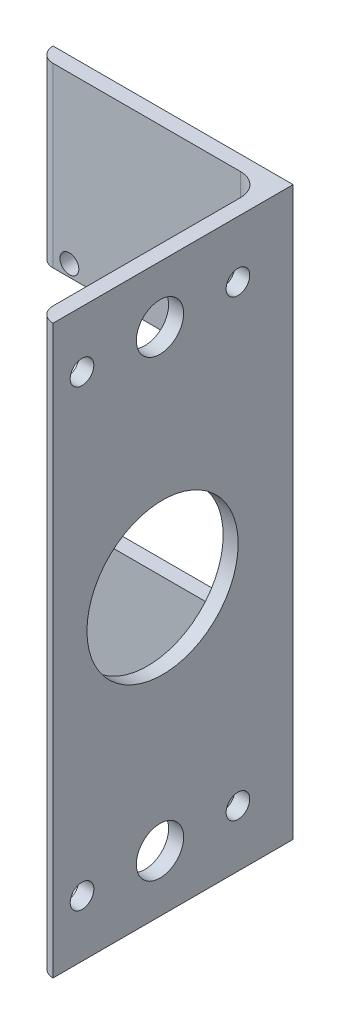
ISO-10303-21;
HEADER;
FILE_DESCRIPTION(('STEP AP214'),'2;1');
FILE_NAME('part.step','',(''),(''),'','','');
FILE_SCHEMA(('AUTOMOTIVE_DESIGN { 1 0 10303 214 1 1 1 1 }'));
ENDSEC;
DATA;
#1=APPLICATION_CONTEXT('core data for automotive mechanical design processes');
#2=APPLICATION_PROTOCOL_DEFINITION('international standard','automotive_design',2000,#1);
#3=PRODUCT_CONTEXT('',#1,'mechanical');
#4=PRODUCT('Part','Part','',(#3));
#5=PRODUCT_RELATED_PRODUCT_CATEGORY('part','',(#4));
#6=PRODUCT_DEFINITION_FORMATION('','',#4);
#7=PRODUCT_DEFINITION_CONTEXT('part definition',#1,'design');
#8=PRODUCT_DEFINITION('design','',#6,#7);
#9=PRODUCT_DEFINITION_SHAPE('','',#8);
#10=(LENGTH_UNIT() NAMED_UNIT(*) SI_UNIT(.MILLI.,.METRE.));
#11=(NAMED_UNIT(*) PLANE_ANGLE_UNIT() SI_UNIT($,.RADIAN.));
#12=(NAMED_UNIT(*) SI_UNIT($,.STERADIAN.) SOLID_ANGLE_UNIT());
#13=UNCERTAINTY_MEASURE_WITH_UNIT(LENGTH_MEASURE(1.E-05),#10,'distance_accuracy_value','');
#14=(GEOMETRIC_REPRESENTATION_CONTEXT(3) GLOBAL_UNCERTAINTY_ASSIGNED_CONTEXT((#13)) GLOBAL_UNIT_ASSIGNED_CONTEXT((#10,
#11,#12)) REPRESENTATION_CONTEXT('',''));
#15=CARTESIAN_POINT('',(0.,0.,0.));
#16=DIRECTION('',(0.,0.,1.));
#17=DIRECTION('',(1.,0.,0.));
#18=AXIS2_PLACEMENT_3D('',#15,#16,#17);
#19=CARTESIAN_POINT('',(-3.175,120.,47.63008));
#20=DIRECTION('',(1.,0.,0.));
#21=DIRECTION('',(0.,0.,-1.));
#22=AXIS2_PLACEMENT_3D('',#19,#20,#21);
#23=PLANE('',#22);
#24=CARTESIAN_POINT('',(-3.175,60.,27.63008));
#25=DIRECTION('',(-1.,0.,0.));
#26=DIRECTION('',(0.,0.,1.));
#27=AXIS2_PLACEMENT_3D('',#24,#25,#26);
#28=CIRCLE('',#27,16.);
#29=CARTESIAN_POINT('',(-3.175,60.,43.63008));
#30=VERTEX_POINT('',#29);
#31=EDGE_CURVE('E569',#30,#30,#28,.T.);
#32=ORIENTED_EDGE('',*,*,#31,.F.);
#33=EDGE_LOOP('',(#32));
#34=FACE_BOUND('',#33,.T.);
#35=CARTESIAN_POINT('',(-3.175,12.,11.675));
#36=DIRECTION('',(-1.,0.,0.));
#37=DIRECTION('',(0.,0.,1.));
#38=AXIS2_PLACEMENT_3D('',#35,#36,#37);
#39=CIRCLE('',#38,2.5);
#40=CARTESIAN_POINT('',(-3.175,12.,14.175));
#41=VERTEX_POINT('',#40);
#42=EDGE_CURVE('E579',#41,#41,#39,.T.);
#43=ORIENTED_EDGE('',*,*,#42,.F.);
#44=EDGE_LOOP('',(#43));
#45=FACE_BOUND('',#44,.T.);
#46=CARTESIAN_POINT('',(-3.17499999999998,12.,44.675));
#47=DIRECTION('',(-1.,0.,0.));
#48=DIRECTION('',(0.,0.,1.));
#49=AXIS2_PLACEMENT_3D('',#46,#47,#48);
#50=CIRCLE('',#49,2.5);
#51=CARTESIAN_POINT('',(-3.17499999999998,12.,47.175));
#52=VERTEX_POINT('',#51);
#53=EDGE_CURVE('E582',#52,#52,#50,.T.);
#54=ORIENTED_EDGE('',*,*,#53,.F.);
#55=EDGE_LOOP('',(#54));
#56=FACE_BOUND('',#55,.T.);
#57=CARTESIAN_POINT('',(-3.175,12.,28.175));
#58=DIRECTION('',(-1.,0.,0.));
#59=DIRECTION('',(0.,0.,1.));
#60=AXIS2_PLACEMENT_3D('',#57,#58,#59);
#61=CIRCLE('',#60,5.);
#62=CARTESIAN_POINT('',(-3.17499999999999,12.,33.175));
#63=VERTEX_POINT('',#62);
#64=EDGE_CURVE('E245',#63,#63,#61,.T.);
#65=ORIENTED_EDGE('',*,*,#64,.F.);
#66=EDGE_LOOP('',(#65));
#67=FACE_BOUND('',#66,.T.);
#68=DIRECTION('',(0.,-1.,0.));
#69=VECTOR('',#68,1.);
#70=CARTESIAN_POINT('',(-3.17500000000001,120.,7.93749999999999));
#71=LINE('',#70,#69);
#72=CARTESIAN_POINT('',(-3.17500000000001,120.,7.93749999999999));
#73=VERTEX_POINT('',#72);
#74=CARTESIAN_POINT('',(-3.17500000000001,82.5,7.93749999999999));
#75=VERTEX_POINT('',#74);
#76=EDGE_CURVE('E226',#73,#75,#71,.T.);
#77=ORIENTED_EDGE('',*,*,#76,.T.);
#78=DIRECTION('',(0.,0.,-1.));
#79=VECTOR('',#78,1.);
#80=CARTESIAN_POINT('',(-3.175,82.5,10.));
#81=LINE('',#80,#79);
#82=CARTESIAN_POINT('',(-3.175,82.5,0.));
#83=VERTEX_POINT('',#82);
#84=EDGE_CURVE('E100',#75,#83,#81,.T.);
#85=ORIENTED_EDGE('',*,*,#84,.T.);
#86=DIRECTION('',(0.,-1.,0.));
#87=VECTOR('',#86,1.);
#88=CARTESIAN_POINT('',(-3.175,82.5,0.));
#89=LINE('',#88,#87);
#90=CARTESIAN_POINT('',(-3.175,37.5,0.));
#91=VERTEX_POINT('',#90);
#92=EDGE_CURVE('E261',#83,#91,#89,.T.);
#93=ORIENTED_EDGE('',*,*,#92,.T.);
#94=DIRECTION('',(0.,0.,-1.));
#95=VECTOR('',#94,1.);
#96=CARTESIAN_POINT('',(-3.175,37.5,10.));
#97=LINE('',#96,#95);
#98=CARTESIAN_POINT('',(-3.175,37.5,7.93749999999999));
#99=VERTEX_POINT('',#98);
#100=EDGE_CURVE('E280',#99,#91,#97,.T.);
#101=ORIENTED_EDGE('',*,*,#100,.F.);
#102=CARTESIAN_POINT('',(-3.17500000000001,0.,7.93749999999999));
#103=VERTEX_POINT('',#102);
#104=EDGE_CURVE('E225',#99,#103,#71,.T.);
#105=ORIENTED_EDGE('',*,*,#104,.T.);
#106=DIRECTION('',(0.,0.,1.));
#107=VECTOR('',#106,1.);
#108=CARTESIAN_POINT('',(-3.175,0.,47.63008));
#109=LINE('',#108,#107);
#110=CARTESIAN_POINT('',(-3.175,0.,47.63008));
#111=VERTEX_POINT('',#110);
#112=EDGE_CURVE('E215',#103,#111,#109,.T.);
#113=ORIENTED_EDGE('',*,*,#112,.T.);
#114=DIRECTION('',(0.,-1.,0.));
#115=VECTOR('',#114,1.);
#116=CARTESIAN_POINT('',(-3.17499999999998,120.,47.63008));
#117=LINE('',#116,#115);
#118=CARTESIAN_POINT('',(-3.17499999999998,120.,47.63008));
#119=VERTEX_POINT('',#118);
#120=EDGE_CURVE('E190',#119,#111,#117,.T.);
#121=ORIENTED_EDGE('',*,*,#120,.F.);
#122=DIRECTION('',(0.,0.,1.));
#123=VECTOR('',#122,1.);
#124=CARTESIAN_POINT('',(-3.175,120.,47.63008));
#125=LINE('',#124,#123);
#126=EDGE_CURVE('E178',#73,#119,#125,.T.);
#127=ORIENTED_EDGE('',*,*,#126,.F.);
#128=EDGE_LOOP('',(#77,#85,#93,#101,#105,#113,#121,#127));
#129=FACE_BOUND('',#128,.T.);
#130=CARTESIAN_POINT('',(-3.17500000000001,108.,11.675));
#131=DIRECTION('',(-1.,0.,0.));
#132=DIRECTION('',(0.,0.,1.));
#133=AXIS2_PLACEMENT_3D('',#130,#131,#132);
#134=CIRCLE('',#133,2.5);
#135=CARTESIAN_POINT('',(-3.17500000000001,108.,14.175));
#136=VERTEX_POINT('',#135);
#137=EDGE_CURVE('E575',#136,#136,#134,.F.);
#138=ORIENTED_EDGE('',*,*,#137,.T.);
#139=EDGE_LOOP('',(#138));
#140=FACE_BOUND('',#139,.T.);
#141=CARTESIAN_POINT('',(-3.175,108.,28.175));
#142=DIRECTION('',(-1.,0.,0.));
#143=DIRECTION('',(0.,0.,1.));
#144=AXIS2_PLACEMENT_3D('',#141,#142,#143);
#145=CIRCLE('',#144,5.);
#146=CARTESIAN_POINT('',(-3.17499999999999,108.,33.175));
#147=VERTEX_POINT('',#146);
#148=EDGE_CURVE('E578',#147,#147,#145,.F.);
#149=ORIENTED_EDGE('',*,*,#148,.T.);
#150=EDGE_LOOP('',(#149));
#151=FACE_BOUND('',#150,.T.);
#152=CARTESIAN_POINT('',(-3.175,108.,44.675));
#153=DIRECTION('',(-1.,0.,0.));
#154=DIRECTION('',(0.,0.,1.));
#155=AXIS2_PLACEMENT_3D('',#152,#153,#154);
#156=CIRCLE('',#155,2.5);
#157=CARTESIAN_POINT('',(-3.175,108.,47.175));
#158=VERTEX_POINT('',#157);
#159=EDGE_CURVE('E585',#158,#158,#156,.F.);
#160=ORIENTED_EDGE('',*,*,#159,.T.);
#161=EDGE_LOOP('',(#160));
#162=FACE_BOUND('',#161,.T.);
#163=ADVANCED_FACE('F83',(#34,#45,#56,#67,#129,#140,#151,#162),#23,.F.);
#164=CARTESIAN_POINT('',(0.,120.,0.));
#165=DIRECTION('',(-1.,0.,0.));
#166=DIRECTION('',(0.,0.,1.));
#167=AXIS2_PLACEMENT_3D('',#164,#165,#166);
#168=PLANE('',#167);
#169=CARTESIAN_POINT('',(0.,60.,27.63008));
#170=DIRECTION('',(-1.,0.,0.));
#171=DIRECTION('',(0.,0.,1.));
#172=AXIS2_PLACEMENT_3D('',#169,#170,#171);
#173=CIRCLE('',#172,16.);
#174=CARTESIAN_POINT('',(0.,60.,43.63008));
#175=VERTEX_POINT('',#174);
#176=EDGE_CURVE('E572',#175,#175,#173,.F.);
#177=ORIENTED_EDGE('',*,*,#176,.F.);
#178=EDGE_LOOP('',(#177));
#179=FACE_BOUND('',#178,.T.);
#180=CARTESIAN_POINT('',(0.,12.,11.675));
#181=DIRECTION('',(-1.,0.,0.));
#182=DIRECTION('',(0.,0.,1.));
#183=AXIS2_PLACEMENT_3D('',#180,#181,#182);
#184=CIRCLE('',#183,2.5);
#185=CARTESIAN_POINT('',(0.,12.,14.175));
#186=VERTEX_POINT('',#185);
#187=EDGE_CURVE('E87',#186,#186,#184,.T.);
#188=ORIENTED_EDGE('',*,*,#187,.T.);
#189=EDGE_LOOP('',(#188));
#190=FACE_BOUND('',#189,.T.);
#191=CARTESIAN_POINT('',(0.,12.,44.675));
#192=DIRECTION('',(-1.,0.,0.));
#193=DIRECTION('',(0.,0.,1.));
#194=AXIS2_PLACEMENT_3D('',#191,#192,#193);
#195=CIRCLE('',#194,2.5);
#196=CARTESIAN_POINT('',(0.,12.,47.175));
#197=VERTEX_POINT('',#196);
#198=EDGE_CURVE('E253',#197,#197,#195,.T.);
#199=ORIENTED_EDGE('',*,*,#198,.T.);
#200=EDGE_LOOP('',(#199));
#201=FACE_BOUND('',#200,.T.);
#202=CARTESIAN_POINT('',(0.,12.,28.175));
#203=DIRECTION('',(-1.,0.,0.));
#204=DIRECTION('',(0.,0.,1.));
#205=AXIS2_PLACEMENT_3D('',#202,#203,#204);
#206=CIRCLE('',#205,5.);
#207=CARTESIAN_POINT('',(0.,12.,33.175));
#208=VERTEX_POINT('',#207);
#209=EDGE_CURVE('E241',#208,#208,#206,.T.);
#210=ORIENTED_EDGE('',*,*,#209,.T.);
#211=EDGE_LOOP('',(#210));
#212=FACE_BOUND('',#211,.T.);
#213=DIRECTION('',(0.,0.,-1.));
#214=VECTOR('',#213,1.);
#215=CARTESIAN_POINT('',(0.,0.,0.));
#216=LINE('',#215,#214);
#217=CARTESIAN_POINT('',(0.,0.,50.8));
#218=VERTEX_POINT('',#217);
#219=CARTESIAN_POINT('',(0.,0.,0.));
#220=VERTEX_POINT('',#219);
#221=EDGE_CURVE('E145',#218,#220,#216,.T.);
#222=ORIENTED_EDGE('',*,*,#221,.T.);
#223=DIRECTION('',(0.,-1.,0.));
#224=VECTOR('',#223,1.);
#225=CARTESIAN_POINT('',(0.,120.,0.));
#226=LINE('',#225,#224);
#227=CARTESIAN_POINT('',(0.,120.,0.));
#228=VERTEX_POINT('',#227);
#229=EDGE_CURVE('E195',#228,#220,#226,.T.);
#230=ORIENTED_EDGE('',*,*,#229,.F.);
#231=DIRECTION('',(0.,0.,-1.));
#232=VECTOR('',#231,1.);
#233=CARTESIAN_POINT('',(0.,120.,0.));
#234=LINE('',#233,#232);
#235=CARTESIAN_POINT('',(0.,120.,50.8));
#236=VERTEX_POINT('',#235);
#237=EDGE_CURVE('E109',#236,#228,#234,.T.);
#238=ORIENTED_EDGE('',*,*,#237,.F.);
#239=DIRECTION('',(0.,-1.,0.));
#240=VECTOR('',#239,1.);
#241=CARTESIAN_POINT('',(0.,120.,50.8));
#242=LINE('',#241,#240);
#243=EDGE_CURVE('E191',#236,#218,#242,.T.);
#244=ORIENTED_EDGE('',*,*,#243,.T.);
#245=EDGE_LOOP('',(#222,#230,#238,#244));
#246=FACE_BOUND('',#245,.T.);
#247=CARTESIAN_POINT('',(0.,108.,11.675));
#248=DIRECTION('',(-1.,0.,0.));
#249=DIRECTION('',(0.,0.,1.));
#250=AXIS2_PLACEMENT_3D('',#247,#248,#249);
#251=CIRCLE('',#250,2.5);
#252=CARTESIAN_POINT('',(0.,108.,14.175));
#253=VERTEX_POINT('',#252);
#254=EDGE_CURVE('E244',#253,#253,#251,.F.);
#255=ORIENTED_EDGE('',*,*,#254,.F.);
#256=EDGE_LOOP('',(#255));
#257=FACE_BOUND('',#256,.T.);
#258=CARTESIAN_POINT('',(0.,108.,28.175));
#259=DIRECTION('',(-1.,0.,0.));
#260=DIRECTION('',(0.,0.,1.));
#261=AXIS2_PLACEMENT_3D('',#258,#259,#260);
#262=CIRCLE('',#261,5.);
#263=CARTESIAN_POINT('',(0.,108.,33.175));
#264=VERTEX_POINT('',#263);
#265=EDGE_CURVE('E248',#264,#264,#262,.F.);
#266=ORIENTED_EDGE('',*,*,#265,.F.);
#267=EDGE_LOOP('',(#266));
#268=FACE_BOUND('',#267,.T.);
#269=CARTESIAN_POINT('',(0.,108.,44.675));
#270=DIRECTION('',(-1.,0.,0.));
#271=DIRECTION('',(0.,0.,1.));
#272=AXIS2_PLACEMENT_3D('',#269,#270,#271);
#273=CIRCLE('',#272,2.5);
#274=CARTESIAN_POINT('',(0.,108.,47.175));
#275=VERTEX_POINT('',#274);
#276=EDGE_CURVE('E251',#275,#275,#273,.F.);
#277=ORIENTED_EDGE('',*,*,#276,.F.);
#278=EDGE_LOOP('',(#277));
#279=FACE_BOUND('',#278,.T.);
#280=ADVANCED_FACE('F320',(#179,#190,#201,#212,#246,#257,#268,#279),#168,.F.);
#281=CARTESIAN_POINT('',(-50.8,120.,0.00507999999999065));
#282=DIRECTION('',(1.,0.,0.));
#283=DIRECTION('',(0.,0.,-1.));
#284=AXIS2_PLACEMENT_3D('',#281,#282,#283);
#285=PLANE('',#284);
#286=DIRECTION('',(0.,-1.,0.));
#287=VECTOR('',#286,1.);
#288=CARTESIAN_POINT('',(-50.8,120.,0.00507999999999065));
#289=LINE('',#288,#287);
#290=CARTESIAN_POINT('',(-50.8,37.5,0.00507999999999065));
#291=VERTEX_POINT('',#290);
#292=CARTESIAN_POINT('',(-50.8,0.,0.00507999999999065));
#293=VERTEX_POINT('',#292);
#294=EDGE_CURVE('E237',#291,#293,#289,.T.);
#295=ORIENTED_EDGE('',*,*,#294,.F.);
#296=DIRECTION('',(0.,0.,-1.));
#297=VECTOR('',#296,1.);
#298=CARTESIAN_POINT('',(-50.8,37.5,10.));
#299=LINE('',#298,#297);
#300=CARTESIAN_POINT('',(-50.8,37.5,0.));
#301=VERTEX_POINT('',#300);
#302=EDGE_CURVE('E276',#291,#301,#299,.T.);
#303=ORIENTED_EDGE('',*,*,#302,.T.);
#304=DIRECTION('',(0.,-1.,0.));
#305=VECTOR('',#304,1.);
#306=CARTESIAN_POINT('',(-50.8,120.,0.));
#307=LINE('',#306,#305);
#308=CARTESIAN_POINT('',(-50.8,0.,0.));
#309=VERTEX_POINT('',#308);
#310=EDGE_CURVE('E92',#301,#309,#307,.T.);
#311=ORIENTED_EDGE('',*,*,#310,.T.);
#312=DIRECTION('',(0.,0.,1.));
#313=VECTOR('',#312,1.);
#314=CARTESIAN_POINT('',(-50.8,0.,0.00507999999999065));
#315=LINE('',#314,#313);
#316=EDGE_CURVE('E202',#309,#293,#315,.T.);
#317=ORIENTED_EDGE('',*,*,#316,.T.);
#318=EDGE_LOOP('',(#295,#303,#311,#317));
#319=FACE_BOUND('',#318,.T.);
#320=ADVANCED_FACE('F373',(#319),#285,.F.);
#321=CARTESIAN_POINT('',(-47.63008,120.,0.00507999999999065));
#322=DIRECTION('',(0.,-1.,0.));
#323=DIRECTION('',(0.,0.,-1.));
#324=AXIS2_PLACEMENT_3D('',#321,#322,#323);
#325=CYLINDRICAL_SURFACE('',#324,3.16992);
#326=DIRECTION('',(0.,-1.,0.));
#327=VECTOR('',#326,1.);
#328=CARTESIAN_POINT('',(-47.63008,120.,3.17500000000001));
#329=LINE('',#328,#327);
#330=CARTESIAN_POINT('',(-47.63008,37.5,3.17500000000001));
#331=VERTEX_POINT('',#330);
#332=CARTESIAN_POINT('',(-47.63008,0.,3.17500000000001));
#333=VERTEX_POINT('',#332);
#334=EDGE_CURVE('E233',#331,#333,#329,.T.);
#335=ORIENTED_EDGE('',*,*,#334,.F.);
#336=CARTESIAN_POINT('',(-47.63008,37.5,0.00507999999999065));
#337=DIRECTION('',(0.,-1.,0.));
#338=DIRECTION('',(0.,0.,-1.));
#339=AXIS2_PLACEMENT_3D('',#336,#337,#338);
#340=CIRCLE('',#339,3.16992);
#341=EDGE_CURVE('E203',#331,#291,#340,.T.);
#342=ORIENTED_EDGE('',*,*,#341,.T.);
#343=ORIENTED_EDGE('',*,*,#294,.T.);
#344=CARTESIAN_POINT('',(-47.63008,0.,0.00507999999999065));
#345=DIRECTION('',(0.,1.,0.));
#346=DIRECTION('',(0.,0.,1.));
#347=AXIS2_PLACEMENT_3D('',#344,#345,#346);
#348=CIRCLE('',#347,3.16992);
#349=EDGE_CURVE('E206',#293,#333,#348,.T.);
#350=ORIENTED_EDGE('',*,*,#349,.T.);
#351=EDGE_LOOP('',(#335,#342,#343,#350));
#352=FACE_BOUND('',#351,.T.);
#353=ADVANCED_FACE('F361',(#352),#325,.T.);
#354=CARTESIAN_POINT('',(-7.93750000000001,120.,3.17499999999998));
#355=DIRECTION('',(0.,0.,-1.));
#356=DIRECTION('',(-1.,0.,0.));
#357=AXIS2_PLACEMENT_3D('',#354,#355,#356);
#358=PLANE('',#357);
#359=CARTESIAN_POINT('',(-44.1750000000011,34.9999999999983,3.17500000000001));
#360=DIRECTION('',(0.,0.,-1.));
#361=DIRECTION('',(-1.,0.,0.));
#362=AXIS2_PLACEMENT_3D('',#359,#360,#361);
#363=CIRCLE('',#362,2.);
#364=CARTESIAN_POINT('',(-46.1750000000011,34.9999999999983,3.17500000000001));
#365=VERTEX_POINT('',#364);
#366=EDGE_CURVE('E550',#365,#365,#363,.F.);
#367=ORIENTED_EDGE('',*,*,#366,.F.);
#368=EDGE_LOOP('',(#367));
#369=FACE_BOUND('',#368,.T.);
#370=CARTESIAN_POINT('',(-14.1750000000011,34.999999999998,3.17499999999998));
#371=DIRECTION('',(0.,0.,-1.));
#372=DIRECTION('',(-1.,0.,0.));
#373=AXIS2_PLACEMENT_3D('',#370,#371,#372);
#374=CIRCLE('',#373,2.);
#375=CARTESIAN_POINT('',(-16.1750000000011,34.999999999998,3.17499999999998));
#376=VERTEX_POINT('',#375);
#377=EDGE_CURVE('E565',#376,#376,#374,.F.);
#378=ORIENTED_EDGE('',*,*,#377,.F.);
#379=EDGE_LOOP('',(#378));
#380=FACE_BOUND('',#379,.T.);
#381=DIRECTION('',(0.,-1.,0.));
#382=VECTOR('',#381,1.);
#383=CARTESIAN_POINT('',(-7.93750000000001,120.,3.17499999999998));
#384=LINE('',#383,#382);
#385=CARTESIAN_POINT('',(-7.9375,37.5,3.17499999999998));
#386=VERTEX_POINT('',#385);
#387=CARTESIAN_POINT('',(-7.93750000000001,0.,3.17499999999998));
#388=VERTEX_POINT('',#387);
#389=EDGE_CURVE('E229',#386,#388,#384,.T.);
#390=ORIENTED_EDGE('',*,*,#389,.F.);
#391=DIRECTION('',(-1.,0.,0.));
#392=VECTOR('',#391,1.);
#393=CARTESIAN_POINT('',(-7.9375,37.5,3.17499999999998));
#394=LINE('',#393,#392);
#395=EDGE_CURVE('E295',#386,#331,#394,.T.);
#396=ORIENTED_EDGE('',*,*,#395,.T.);
#397=ORIENTED_EDGE('',*,*,#334,.T.);
#398=DIRECTION('',(1.,0.,0.));
#399=VECTOR('',#398,1.);
#400=CARTESIAN_POINT('',(-7.93750000000001,0.,3.17499999999998));
#401=LINE('',#400,#399);
#402=EDGE_CURVE('E209',#333,#388,#401,.T.);
#403=ORIENTED_EDGE('',*,*,#402,.T.);
#404=EDGE_LOOP('',(#390,#396,#397,#403));
#405=FACE_BOUND('',#404,.T.);
#406=ADVANCED_FACE('F360',(#369,#380,#405),#358,.F.);
#407=CARTESIAN_POINT('',(-7.93750000000001,120.,7.93749999999999));
#408=DIRECTION('',(0.,-1.,0.));
#409=DIRECTION('',(0.,0.,-1.));
#410=AXIS2_PLACEMENT_3D('',#407,#408,#409);
#411=CYLINDRICAL_SURFACE('',#410,4.7625);
#412=ORIENTED_EDGE('',*,*,#104,.F.);
#413=CARTESIAN_POINT('',(-7.9375,37.5,7.93749999999999));
#414=DIRECTION('',(0.,-1.,0.));
#415=DIRECTION('',(0.,0.,-1.));
#416=AXIS2_PLACEMENT_3D('',#413,#414,#415);
#417=CIRCLE('',#416,4.7625);
#418=EDGE_CURVE('E292',#99,#386,#417,.F.);
#419=ORIENTED_EDGE('',*,*,#418,.T.);
#420=ORIENTED_EDGE('',*,*,#389,.T.);
#421=CARTESIAN_POINT('',(-7.93750000000001,0.,7.93749999999999));
#422=DIRECTION('',(0.,-1.,0.));
#423=DIRECTION('',(0.,0.,-1.));
#424=AXIS2_PLACEMENT_3D('',#421,#422,#423);
#425=CIRCLE('',#424,4.7625);
#426=EDGE_CURVE('E212',#388,#103,#425,.T.);
#427=ORIENTED_EDGE('',*,*,#426,.T.);
#428=EDGE_LOOP('',(#412,#419,#420,#427));
#429=FACE_BOUND('',#428,.T.);
#430=ADVANCED_FACE('F367',(#429),#411,.F.);
#431=CARTESIAN_POINT('',(-50.8,120.,0.));
#432=DIRECTION('',(0.,0.,1.));
#433=DIRECTION('',(1.,0.,0.));
#434=AXIS2_PLACEMENT_3D('',#431,#432,#433);
#435=PLANE('',#434);
#436=CARTESIAN_POINT('',(-44.1750000000011,34.9999999999983,0.));
#437=DIRECTION('',(0.,0.,-1.));
#438=DIRECTION('',(-1.,0.,0.));
#439=AXIS2_PLACEMENT_3D('',#436,#437,#438);
#440=CIRCLE('',#439,2.);
#441=CARTESIAN_POINT('',(-46.1750000000011,34.9999999999983,0.));
#442=VERTEX_POINT('',#441);
#443=EDGE_CURVE('E553',#442,#442,#440,.T.);
#444=ORIENTED_EDGE('',*,*,#443,.F.);
#445=EDGE_LOOP('',(#444));
#446=FACE_BOUND('',#445,.T.);
#447=CARTESIAN_POINT('',(-44.1750000000005,84.9999999999983,0.));
#448=DIRECTION('',(0.,0.,-1.));
#449=DIRECTION('',(-1.,0.,0.));
#450=AXIS2_PLACEMENT_3D('',#447,#448,#449);
#451=CIRCLE('',#450,2.);
#452=CARTESIAN_POINT('',(-46.1750000000006,84.9999999999983,0.));
#453=VERTEX_POINT('',#452);
#454=EDGE_CURVE('E556',#453,#453,#451,.T.);
#455=ORIENTED_EDGE('',*,*,#454,.F.);
#456=EDGE_LOOP('',(#455));
#457=FACE_BOUND('',#456,.T.);
#458=CARTESIAN_POINT('',(-14.1750000000006,84.999999999998,0.));
#459=DIRECTION('',(0.,0.,-1.));
#460=DIRECTION('',(-1.,0.,0.));
#461=AXIS2_PLACEMENT_3D('',#458,#459,#460);
#462=CIRCLE('',#461,2.);
#463=CARTESIAN_POINT('',(-16.1750000000006,84.999999999998,0.));
#464=VERTEX_POINT('',#463);
#465=EDGE_CURVE('E633',#464,#464,#462,.T.);
#466=ORIENTED_EDGE('',*,*,#465,.F.);
#467=EDGE_LOOP('',(#466));
#468=FACE_BOUND('',#467,.T.);
#469=CARTESIAN_POINT('',(-14.1750000000011,34.999999999998,0.));
#470=DIRECTION('',(0.,0.,-1.));
#471=DIRECTION('',(-1.,0.,0.));
#472=AXIS2_PLACEMENT_3D('',#469,#470,#471);
#473=CIRCLE('',#472,2.);
#474=CARTESIAN_POINT('',(-16.1750000000011,34.999999999998,0.));
#475=VERTEX_POINT('',#474);
#476=EDGE_CURVE('E562',#475,#475,#473,.T.);
#477=ORIENTED_EDGE('',*,*,#476,.F.);
#478=EDGE_LOOP('',(#477));
#479=FACE_BOUND('',#478,.T.);
#480=ORIENTED_EDGE('',*,*,#310,.F.);
#481=DIRECTION('',(-1.,0.,0.));
#482=VECTOR('',#481,1.);
#483=CARTESIAN_POINT('',(-3.175,37.5,0.));
#484=LINE('',#483,#482);
#485=EDGE_CURVE('E268',#91,#301,#484,.T.);
#486=ORIENTED_EDGE('',*,*,#485,.F.);
#487=ORIENTED_EDGE('',*,*,#92,.F.);
#488=DIRECTION('',(1.,0.,0.));
#489=VECTOR('',#488,1.);
#490=CARTESIAN_POINT('',(-3.175,82.5,0.));
#491=LINE('',#490,#489);
#492=CARTESIAN_POINT('',(-50.8,82.5,0.));
#493=VERTEX_POINT('',#492);
#494=EDGE_CURVE('E258',#493,#83,#491,.T.);
#495=ORIENTED_EDGE('',*,*,#494,.F.);
#496=CARTESIAN_POINT('',(-50.8,120.,0.));
#497=VERTEX_POINT('',#496);
#498=EDGE_CURVE('E15',#497,#493,#307,.T.);
#499=ORIENTED_EDGE('',*,*,#498,.F.);
#500=DIRECTION('',(-1.,0.,0.));
#501=VECTOR('',#500,1.);
#502=CARTESIAN_POINT('',(-50.8,120.,0.));
#503=LINE('',#502,#501);
#504=EDGE_CURVE('E221',#228,#497,#503,.T.);
#505=ORIENTED_EDGE('',*,*,#504,.F.);
#506=ORIENTED_EDGE('',*,*,#229,.T.);
#507=DIRECTION('',(-1.,0.,0.));
#508=VECTOR('',#507,1.);
#509=CARTESIAN_POINT('',(-50.8,0.,0.));
#510=LINE('',#509,#508);
#511=EDGE_CURVE('E199',#220,#309,#510,.T.);
#512=ORIENTED_EDGE('',*,*,#511,.T.);
#513=EDGE_LOOP('',(#480,#486,#487,#495,#499,#505,#506,#512));
#514=FACE_BOUND('',#513,.T.);
#515=ADVANCED_FACE('F85',(#446,#457,#468,#479,#514),#435,.F.);
#516=ORIENTED_EDGE('',*,*,#498,.T.);
#517=DIRECTION('',(0.,0.,-1.));
#518=VECTOR('',#517,1.);
#519=CARTESIAN_POINT('',(-50.8,82.5,10.));
#520=LINE('',#519,#518);
#521=CARTESIAN_POINT('',(-50.8,82.5,0.00507999999999065));
#522=VERTEX_POINT('',#521);
#523=EDGE_CURVE('E275',#522,#493,#520,.T.);
#524=ORIENTED_EDGE('',*,*,#523,.F.);
#525=CARTESIAN_POINT('',(-50.8,120.,0.00507999999999065));
#526=VERTEX_POINT('',#525);
#527=EDGE_CURVE('E238',#526,#522,#289,.T.);
#528=ORIENTED_EDGE('',*,*,#527,.F.);
#529=DIRECTION('',(0.,0.,1.));
#530=VECTOR('',#529,1.);
#531=CARTESIAN_POINT('',(-50.8,120.,0.00507999999999065));
#532=LINE('',#531,#530);
#533=EDGE_CURVE('E153',#497,#526,#532,.T.);
#534=ORIENTED_EDGE('',*,*,#533,.F.);
#535=EDGE_LOOP('',(#516,#524,#528,#534));
#536=FACE_BOUND('',#535,.T.);
#537=ADVANCED_FACE('F329',(#536),#285,.F.);
#538=ORIENTED_EDGE('',*,*,#527,.T.);
#539=CARTESIAN_POINT('',(-47.63008,82.5,0.00507999999999065));
#540=DIRECTION('',(0.,1.,0.));
#541=DIRECTION('',(0.,0.,1.));
#542=AXIS2_PLACEMENT_3D('',#539,#540,#541);
#543=CIRCLE('',#542,3.16992);
#544=CARTESIAN_POINT('',(-47.63008,82.5,3.17500000000001));
#545=VERTEX_POINT('',#544);
#546=EDGE_CURVE('E289',#522,#545,#543,.T.);
#547=ORIENTED_EDGE('',*,*,#546,.T.);
#548=CARTESIAN_POINT('',(-47.63008,120.,3.17500000000001));
#549=VERTEX_POINT('',#548);
#550=EDGE_CURVE('E234',#549,#545,#329,.T.);
#551=ORIENTED_EDGE('',*,*,#550,.F.);
#552=CARTESIAN_POINT('',(-47.63008,120.,0.00507999999999065));
#553=DIRECTION('',(0.,1.,0.));
#554=DIRECTION('',(0.,0.,1.));
#555=AXIS2_PLACEMENT_3D('',#552,#553,#554);
#556=CIRCLE('',#555,3.16992);
#557=EDGE_CURVE('E302',#526,#549,#556,.T.);
#558=ORIENTED_EDGE('',*,*,#557,.F.);
#559=EDGE_LOOP('',(#538,#547,#551,#558));
#560=FACE_BOUND('',#559,.T.);
#561=ADVANCED_FACE('F332',(#560),#325,.T.);
#562=CARTESIAN_POINT('',(-44.1750000000005,84.9999999999983,3.17500000000001));
#563=DIRECTION('',(0.,0.,-1.));
#564=DIRECTION('',(-1.,0.,0.));
#565=AXIS2_PLACEMENT_3D('',#562,#563,#564);
#566=CIRCLE('',#565,2.);
#567=CARTESIAN_POINT('',(-46.1750000000006,84.9999999999983,3.17500000000001));
#568=VERTEX_POINT('',#567);
#569=EDGE_CURVE('E559',#568,#568,#566,.F.);
#570=ORIENTED_EDGE('',*,*,#569,.F.);
#571=EDGE_LOOP('',(#570));
#572=FACE_BOUND('',#571,.T.);
#573=CARTESIAN_POINT('',(-14.1750000000006,84.999999999998,3.17499999999998));
#574=DIRECTION('',(0.,0.,-1.));
#575=DIRECTION('',(-1.,0.,0.));
#576=AXIS2_PLACEMENT_3D('',#573,#574,#575);
#577=CIRCLE('',#576,2.);
#578=CARTESIAN_POINT('',(-16.1750000000006,84.999999999998,3.17499999999998));
#579=VERTEX_POINT('',#578);
#580=EDGE_CURVE('E566',#579,#579,#577,.F.);
#581=ORIENTED_EDGE('',*,*,#580,.F.);
#582=EDGE_LOOP('',(#581));
#583=FACE_BOUND('',#582,.T.);
#584=ORIENTED_EDGE('',*,*,#550,.T.);
#585=DIRECTION('',(1.,0.,0.));
#586=VECTOR('',#585,1.);
#587=CARTESIAN_POINT('',(-7.9375,82.5,3.17499999999998));
#588=LINE('',#587,#586);
#589=CARTESIAN_POINT('',(-7.9375,82.5,3.17499999999998));
#590=VERTEX_POINT('',#589);
#591=EDGE_CURVE('E286',#545,#590,#588,.T.);
#592=ORIENTED_EDGE('',*,*,#591,.T.);
#593=CARTESIAN_POINT('',(-7.93750000000001,120.,3.17499999999998));
#594=VERTEX_POINT('',#593);
#595=EDGE_CURVE('E230',#594,#590,#384,.T.);
#596=ORIENTED_EDGE('',*,*,#595,.F.);
#597=DIRECTION('',(1.,0.,0.));
#598=VECTOR('',#597,1.);
#599=CARTESIAN_POINT('',(-7.93750000000001,120.,3.17499999999998));
#600=LINE('',#599,#598);
#601=EDGE_CURVE('E304',#549,#594,#600,.T.);
#602=ORIENTED_EDGE('',*,*,#601,.F.);
#603=EDGE_LOOP('',(#584,#592,#596,#602));
#604=FACE_BOUND('',#603,.T.);
#605=ADVANCED_FACE('F336',(#572,#583,#604),#358,.F.);
#606=ORIENTED_EDGE('',*,*,#595,.T.);
#607=CARTESIAN_POINT('',(-7.9375,82.5,7.93749999999999));
#608=DIRECTION('',(0.,1.,0.));
#609=DIRECTION('',(0.,0.,1.));
#610=AXIS2_PLACEMENT_3D('',#607,#608,#609);
#611=CIRCLE('',#610,4.7625);
#612=EDGE_CURVE('E279',#590,#75,#611,.F.);
#613=ORIENTED_EDGE('',*,*,#612,.T.);
#614=ORIENTED_EDGE('',*,*,#76,.F.);
#615=CARTESIAN_POINT('',(-7.93750000000001,120.,7.93749999999999));
#616=DIRECTION('',(0.,-1.,0.));
#617=DIRECTION('',(0.,0.,-1.));
#618=AXIS2_PLACEMENT_3D('',#615,#616,#617);
#619=CIRCLE('',#618,4.7625);
#620=EDGE_CURVE('E306',#594,#73,#619,.T.);
#621=ORIENTED_EDGE('',*,*,#620,.F.);
#622=EDGE_LOOP('',(#606,#613,#614,#621));
#623=FACE_BOUND('',#622,.T.);
#624=ADVANCED_FACE('F312',(#623),#411,.F.);
#625=CARTESIAN_POINT('',(-0.00507999999999065,120.,47.63008));
#626=DIRECTION('',(0.,-1.,0.));
#627=DIRECTION('',(0.,0.,-1.));
#628=AXIS2_PLACEMENT_3D('',#625,#626,#627);
#629=CYLINDRICAL_SURFACE('',#628,3.16992);
#630=CARTESIAN_POINT('',(-0.00508000000000453,0.,47.63008));
#631=DIRECTION('',(0.,1.,0.));
#632=DIRECTION('',(0.,0.,-1.));
#633=AXIS2_PLACEMENT_3D('',#630,#631,#632);
#634=CIRCLE('',#633,3.16992);
#635=CARTESIAN_POINT('',(-0.00508000000000453,0.,50.8));
#636=VERTEX_POINT('',#635);
#637=EDGE_CURVE('E187',#111,#636,#634,.T.);
#638=ORIENTED_EDGE('',*,*,#637,.T.);
#639=DIRECTION('',(0.,-1.,0.));
#640=VECTOR('',#639,1.);
#641=CARTESIAN_POINT('',(-0.00507999999999065,120.,50.8));
#642=LINE('',#641,#640);
#643=CARTESIAN_POINT('',(-0.00507999999999065,120.,50.8));
#644=VERTEX_POINT('',#643);
#645=EDGE_CURVE('E184',#644,#636,#642,.T.);
#646=ORIENTED_EDGE('',*,*,#645,.F.);
#647=CARTESIAN_POINT('',(-0.00507999999999065,120.,47.63008));
#648=DIRECTION('',(0.,1.,0.));
#649=DIRECTION('',(0.,0.,-1.));
#650=AXIS2_PLACEMENT_3D('',#647,#648,#649);
#651=CIRCLE('',#650,3.16992);
#652=EDGE_CURVE('E171',#119,#644,#651,.T.);
#653=ORIENTED_EDGE('',*,*,#652,.F.);
#654=ORIENTED_EDGE('',*,*,#120,.T.);
#655=EDGE_LOOP('',(#638,#646,#653,#654));
#656=FACE_BOUND('',#655,.T.);
#657=ADVANCED_FACE('F185',(#656),#629,.T.);
#658=CARTESIAN_POINT('',(0.,120.,50.8));
#659=DIRECTION('',(0.,0.,-1.));
#660=DIRECTION('',(-1.,0.,0.));
#661=AXIS2_PLACEMENT_3D('',#658,#659,#660);
#662=PLANE('',#661);
#663=DIRECTION('',(1.,0.,0.));
#664=VECTOR('',#663,1.);
#665=CARTESIAN_POINT('',(0.,0.,50.8));
#666=LINE('',#665,#664);
#667=EDGE_CURVE('E218',#636,#218,#666,.T.);
#668=ORIENTED_EDGE('',*,*,#667,.T.);
#669=ORIENTED_EDGE('',*,*,#243,.F.);
#670=DIRECTION('',(1.,0.,0.));
#671=VECTOR('',#670,1.);
#672=CARTESIAN_POINT('',(0.,120.,50.8));
#673=LINE('',#672,#671);
#674=EDGE_CURVE('E175',#644,#236,#673,.T.);
#675=ORIENTED_EDGE('',*,*,#674,.F.);
#676=ORIENTED_EDGE('',*,*,#645,.T.);
#677=EDGE_LOOP('',(#668,#669,#675,#676));
#678=FACE_BOUND('',#677,.T.);
#679=ADVANCED_FACE('F193',(#678),#662,.F.);
#680=CARTESIAN_POINT('',(-0.00507999999999065,120.,47.63008));
#681=DIRECTION('',(0.,-1.,0.));
#682=DIRECTION('',(0.,0.,-1.));
#683=AXIS2_PLACEMENT_3D('',#680,#681,#682);
#684=PLANE('',#683);
#685=ORIENTED_EDGE('',*,*,#504,.T.);
#686=ORIENTED_EDGE('',*,*,#533,.T.);
#687=ORIENTED_EDGE('',*,*,#557,.T.);
#688=ORIENTED_EDGE('',*,*,#601,.T.);
#689=ORIENTED_EDGE('',*,*,#620,.T.);
#690=ORIENTED_EDGE('',*,*,#126,.T.);
#691=ORIENTED_EDGE('',*,*,#652,.T.);
#692=ORIENTED_EDGE('',*,*,#674,.T.);
#693=ORIENTED_EDGE('',*,*,#237,.T.);
#694=EDGE_LOOP('',(#685,#686,#687,#688,#689,#690,#691,#692,#693));
#695=FACE_BOUND('',#694,.T.);
#696=ADVANCED_FACE('F173',(#695),#684,.F.);
#697=CARTESIAN_POINT('',(-0.00508000000000453,0.,47.63008));
#698=DIRECTION('',(0.,-1.,0.));
#699=DIRECTION('',(0.,0.,-1.));
#700=AXIS2_PLACEMENT_3D('',#697,#698,#699);
#701=PLANE('',#700);
#702=ORIENTED_EDGE('',*,*,#511,.F.);
#703=ORIENTED_EDGE('',*,*,#221,.F.);
#704=ORIENTED_EDGE('',*,*,#667,.F.);
#705=ORIENTED_EDGE('',*,*,#637,.F.);
#706=ORIENTED_EDGE('',*,*,#112,.F.);
#707=ORIENTED_EDGE('',*,*,#426,.F.);
#708=ORIENTED_EDGE('',*,*,#402,.F.);
#709=ORIENTED_EDGE('',*,*,#349,.F.);
#710=ORIENTED_EDGE('',*,*,#316,.F.);
#711=EDGE_LOOP('',(#702,#703,#704,#705,#706,#707,#708,#709,#710));
#712=FACE_BOUND('',#711,.T.);
#713=ADVANCED_FACE('F318',(#712),#701,.T.);
#714=CARTESIAN_POINT('',(-3.175,37.5,10.));
#715=DIRECTION('',(0.,-1.,0.));
#716=DIRECTION('',(0.,0.,-1.));
#717=AXIS2_PLACEMENT_3D('',#714,#715,#716);
#718=PLANE('',#717);
#719=ORIENTED_EDGE('',*,*,#395,.F.);
#720=ORIENTED_EDGE('',*,*,#418,.F.);
#721=ORIENTED_EDGE('',*,*,#100,.T.);
#722=ORIENTED_EDGE('',*,*,#485,.T.);
#723=ORIENTED_EDGE('',*,*,#302,.F.);
#724=ORIENTED_EDGE('',*,*,#341,.F.);
#725=EDGE_LOOP('',(#719,#720,#721,#722,#723,#724));
#726=FACE_BOUND('',#725,.T.);
#727=ADVANCED_FACE('F354',(#726),#718,.F.);
#728=CARTESIAN_POINT('',(-3.175,82.5,10.));
#729=DIRECTION('',(0.,1.,0.));
#730=DIRECTION('',(0.,0.,1.));
#731=AXIS2_PLACEMENT_3D('',#728,#729,#730);
#732=PLANE('',#731);
#733=ORIENTED_EDGE('',*,*,#523,.T.);
#734=ORIENTED_EDGE('',*,*,#494,.T.);
#735=ORIENTED_EDGE('',*,*,#84,.F.);
#736=ORIENTED_EDGE('',*,*,#612,.F.);
#737=ORIENTED_EDGE('',*,*,#591,.F.);
#738=ORIENTED_EDGE('',*,*,#546,.F.);
#739=EDGE_LOOP('',(#733,#734,#735,#736,#737,#738));
#740=FACE_BOUND('',#739,.T.);
#741=ADVANCED_FACE('F447',(#740),#732,.F.);
#742=CARTESIAN_POINT('',(6.82500000000001,12.,28.175));
#743=DIRECTION('',(-1.,0.,0.));
#744=DIRECTION('',(0.,0.,1.));
#745=AXIS2_PLACEMENT_3D('',#742,#743,#744);
#746=CYLINDRICAL_SURFACE('',#745,5.);
#747=ORIENTED_EDGE('',*,*,#64,.T.);
#748=EDGE_LOOP('',(#747));
#749=FACE_BOUND('',#748,.T.);
#750=ORIENTED_EDGE('',*,*,#209,.F.);
#751=EDGE_LOOP('',(#750));
#752=FACE_BOUND('',#751,.T.);
#753=ADVANCED_FACE('F455',(#749,#752),#746,.F.);
#754=CARTESIAN_POINT('',(6.825,108.,11.675));
#755=DIRECTION('',(-1.,0.,0.));
#756=DIRECTION('',(0.,0.,1.));
#757=AXIS2_PLACEMENT_3D('',#754,#755,#756);
#758=CYLINDRICAL_SURFACE('',#757,2.5);
#759=ORIENTED_EDGE('',*,*,#137,.F.);
#760=EDGE_LOOP('',(#759));
#761=FACE_BOUND('',#760,.T.);
#762=ORIENTED_EDGE('',*,*,#254,.T.);
#763=EDGE_LOOP('',(#762));
#764=FACE_BOUND('',#763,.T.);
#765=ADVANCED_FACE('F463',(#761,#764),#758,.F.);
#766=CARTESIAN_POINT('',(6.825,108.,28.175));
#767=DIRECTION('',(-1.,0.,0.));
#768=DIRECTION('',(0.,0.,1.));
#769=AXIS2_PLACEMENT_3D('',#766,#767,#768);
#770=CYLINDRICAL_SURFACE('',#769,5.);
#771=ORIENTED_EDGE('',*,*,#148,.F.);
#772=EDGE_LOOP('',(#771));
#773=FACE_BOUND('',#772,.T.);
#774=ORIENTED_EDGE('',*,*,#265,.T.);
#775=EDGE_LOOP('',(#774));
#776=FACE_BOUND('',#775,.T.);
#777=ADVANCED_FACE('F472',(#773,#776),#770,.F.);
#778=CARTESIAN_POINT('',(6.82500000000001,108.,44.675));
#779=DIRECTION('',(-1.,0.,0.));
#780=DIRECTION('',(0.,0.,1.));
#781=AXIS2_PLACEMENT_3D('',#778,#779,#780);
#782=CYLINDRICAL_SURFACE('',#781,2.5);
#783=ORIENTED_EDGE('',*,*,#159,.F.);
#784=EDGE_LOOP('',(#783));
#785=FACE_BOUND('',#784,.T.);
#786=ORIENTED_EDGE('',*,*,#276,.T.);
#787=EDGE_LOOP('',(#786));
#788=FACE_BOUND('',#787,.T.);
#789=ADVANCED_FACE('F480',(#785,#788),#782,.F.);
#790=CARTESIAN_POINT('',(6.82500000000001,12.,44.675));
#791=DIRECTION('',(-1.,0.,0.));
#792=DIRECTION('',(0.,0.,1.));
#793=AXIS2_PLACEMENT_3D('',#790,#791,#792);
#794=CYLINDRICAL_SURFACE('',#793,2.5);
#795=ORIENTED_EDGE('',*,*,#53,.T.);
#796=EDGE_LOOP('',(#795));
#797=FACE_BOUND('',#796,.T.);
#798=ORIENTED_EDGE('',*,*,#198,.F.);
#799=EDGE_LOOP('',(#798));
#800=FACE_BOUND('',#799,.T.);
#801=ADVANCED_FACE('F488',(#797,#800),#794,.F.);
#802=CARTESIAN_POINT('',(6.825,12.,11.675));
#803=DIRECTION('',(-1.,0.,0.));
#804=DIRECTION('',(0.,0.,1.));
#805=AXIS2_PLACEMENT_3D('',#802,#803,#804);
#806=CYLINDRICAL_SURFACE('',#805,2.5);
#807=ORIENTED_EDGE('',*,*,#42,.T.);
#808=EDGE_LOOP('',(#807));
#809=FACE_BOUND('',#808,.T.);
#810=ORIENTED_EDGE('',*,*,#187,.F.);
#811=EDGE_LOOP('',(#810));
#812=FACE_BOUND('',#811,.T.);
#813=ADVANCED_FACE('F496',(#809,#812),#806,.F.);
#814=CARTESIAN_POINT('',(45.254833995939,60.,27.63008));
#815=DIRECTION('',(-1.,0.,0.));
#816=DIRECTION('',(0.,0.,1.));
#817=AXIS2_PLACEMENT_3D('',#814,#815,#816);
#818=CYLINDRICAL_SURFACE('',#817,16.);
#819=CARTESIAN_POINT('',(0.,60.,43.63008));
#820=CARTESIAN_POINT('',(-0.033072916666652,60.,43.63008));
#821=CARTESIAN_POINT('',(-0.0661458333333179,60.,43.63008));
#822=CARTESIAN_POINT('',(-0.132291666666652,60.,43.63008));
#823=CARTESIAN_POINT('',(-0.16536458333332,60.,43.63008));
#824=CARTESIAN_POINT('',(-0.231510416666654,60.,43.63008));
#825=CARTESIAN_POINT('',(-0.26458333333332,60.,43.63008));
#826=CARTESIAN_POINT('',(-0.330729166666655,60.,43.63008));
#827=CARTESIAN_POINT('',(-0.363802083333323,60.,43.63008));
#828=CARTESIAN_POINT('',(-0.429947916666657,60.,43.63008));
#829=CARTESIAN_POINT('',(-0.463020833333323,60.,43.63008));
#830=CARTESIAN_POINT('',(-0.529166666666655,60.,43.63008));
#831=CARTESIAN_POINT('',(-0.562239583333321,60.,43.63008));
#832=CARTESIAN_POINT('',(-0.628385416666655,60.,43.63008));
#833=CARTESIAN_POINT('',(-0.661458333333323,60.,43.63008));
#834=CARTESIAN_POINT('',(-0.727604166666657,60.,43.63008));
#835=CARTESIAN_POINT('',(-0.760677083333323,60.,43.63008));
#836=CARTESIAN_POINT('',(-0.826822916666655,60.,43.63008));
#837=CARTESIAN_POINT('',(-0.859895833333321,60.,43.63008));
#838=CARTESIAN_POINT('',(-0.926041666666655,60.,43.63008));
#839=CARTESIAN_POINT('',(-0.959114583333323,60.,43.63008));
#840=CARTESIAN_POINT('',(-1.02526041666666,60.,43.63008));
#841=CARTESIAN_POINT('',(-1.05833333333332,60.,43.63008));
#842=CARTESIAN_POINT('',(-1.12447916666665,60.,43.63008));
#843=CARTESIAN_POINT('',(-1.15755208333332,60.,43.63008));
#844=CARTESIAN_POINT('',(-1.22369791666666,60.,43.63008));
#845=CARTESIAN_POINT('',(-1.25677083333332,60.,43.63008));
#846=CARTESIAN_POINT('',(-1.32291666666666,60.,43.63008));
#847=CARTESIAN_POINT('',(-1.35598958333332,60.,43.63008));
#848=CARTESIAN_POINT('',(-1.42213541666666,60.,43.63008));
#849=CARTESIAN_POINT('',(-1.45520833333333,60.,43.63008));
#850=CARTESIAN_POINT('',(-1.52135416666666,60.,43.63008));
#851=CARTESIAN_POINT('',(-1.55442708333333,60.,43.63008));
#852=CARTESIAN_POINT('',(-1.62057291666666,60.,43.63008));
#853=CARTESIAN_POINT('',(-1.65364583333332,60.,43.63008));
#854=CARTESIAN_POINT('',(-1.71979166666666,60.,43.63008));
#855=CARTESIAN_POINT('',(-1.75286458333333,60.,43.63008));
#856=CARTESIAN_POINT('',(-1.81901041666666,60.,43.63008));
#857=CARTESIAN_POINT('',(-1.85208333333333,60.,43.63008));
#858=CARTESIAN_POINT('',(-1.91822916666666,60.,43.63008));
#859=CARTESIAN_POINT('',(-1.95130208333333,60.,43.63008));
#860=CARTESIAN_POINT('',(-2.01744791666666,60.,43.63008));
#861=CARTESIAN_POINT('',(-2.05052083333333,60.,43.63008));
#862=CARTESIAN_POINT('',(-2.11666666666666,60.,43.63008));
#863=CARTESIAN_POINT('',(-2.14973958333333,60.,43.63008));
#864=CARTESIAN_POINT('',(-2.21588541666666,60.,43.63008));
#865=CARTESIAN_POINT('',(-2.24895833333333,60.,43.63008));
#866=CARTESIAN_POINT('',(-2.31510416666666,60.,43.63008));
#867=CARTESIAN_POINT('',(-2.34817708333333,60.,43.63008));
#868=CARTESIAN_POINT('',(-2.41432291666666,60.,43.63008));
#869=CARTESIAN_POINT('',(-2.44739583333333,60.,43.63008));
#870=CARTESIAN_POINT('',(-2.51354166666666,60.,43.63008));
#871=CARTESIAN_POINT('',(-2.54661458333333,60.,43.63008));
#872=CARTESIAN_POINT('',(-2.61276041666666,60.,43.63008));
#873=CARTESIAN_POINT('',(-2.64583333333333,60.,43.63008));
#874=CARTESIAN_POINT('',(-2.71197916666666,60.,43.63008));
#875=CARTESIAN_POINT('',(-2.74505208333333,60.,43.63008));
#876=CARTESIAN_POINT('',(-2.81119791666666,60.,43.63008));
#877=CARTESIAN_POINT('',(-2.84427083333333,60.,43.63008));
#878=CARTESIAN_POINT('',(-2.91041666666666,60.,43.63008));
#879=CARTESIAN_POINT('',(-2.94348958333333,60.,43.63008));
#880=CARTESIAN_POINT('',(-3.00963541666666,60.,43.63008));
#881=CARTESIAN_POINT('',(-3.04270833333333,60.,43.63008));
#882=CARTESIAN_POINT('',(-3.10885416666667,60.,43.63008));
#883=CARTESIAN_POINT('',(-3.14192708333333,60.,43.63008));
#884=CARTESIAN_POINT('',(-3.175,60.,43.63008));
#885=B_SPLINE_CURVE_WITH_KNOTS('',3,(#819,#820,#821,#822,#823,#824,#825,#826,#827,#828,#829,
#830,#831,#832,#833,#834,#835,#836,#837,#838,#839,#840,#841,#842,#843,#844,#845,#846,#847,#848,
#849,#850,#851,#852,#853,#854,#855,#856,#857,#858,#859,#860,#861,#862,#863,#864,#865,#866,#867,
#868,#869,#870,#871,#872,#873,#874,#875,#876,#877,#878,#879,#880,#881,#882,#883,#884),
.UNSPECIFIED.,.F.,.F.,(4,2,2,2,2,2,2,2,2,2,2,2,2,2,2,2,2,2,2,2,2,2,2,2,2,2,2,2,2,2,2,2,4),(0.,
0.0992187499999977,0.198437500000002,0.29765625,0.396875000000005,0.496093750000003,0.5953125,
0.694531250000005,0.793750000000003,0.892968750000001,0.992187500000005,1.09140625,1.190625,
1.28984375000001,1.3890625,1.48828125000001,1.58750000000001,1.68671875,1.78593750000001,
1.88515625000001,1.98437500000001,2.08359375000001,2.18281250000001,2.28203125000001,
2.38125000000001,2.48046875000001,2.57968750000001,2.67890625000001,2.77812500000001,
2.87734375000001,2.97656250000001,3.07578125000001,3.17500000000001),.UNSPECIFIED.);
#886=EDGE_CURVE('BSEAM504',#175,#30,#885,.T.);
#887=ORIENTED_EDGE('',*,*,#176,.T.);
#888=ORIENTED_EDGE('',*,*,#31,.T.);
#889=ORIENTED_EDGE('',*,*,#886,.T.);
#890=ORIENTED_EDGE('',*,*,#886,.F.);
#891=EDGE_LOOP('',(#887,#889,#888,#890));
#892=FACE_BOUND('',#891,.T.);
#893=ADVANCED_FACE('F504',(#892),#818,.F.);
#894=CARTESIAN_POINT('',(-14.1750000000006,84.999999999998,8.83185424949237));
#895=DIRECTION('',(0.,0.,-1.));
#896=DIRECTION('',(-1.,0.,0.));
#897=AXIS2_PLACEMENT_3D('',#894,#895,#896);
#898=CYLINDRICAL_SURFACE('',#897,2.);
#899=ORIENTED_EDGE('',*,*,#580,.T.);
#900=EDGE_LOOP('',(#899));
#901=FACE_BOUND('',#900,.T.);
#902=ORIENTED_EDGE('',*,*,#465,.T.);
#903=EDGE_LOOP('',(#902));
#904=FACE_BOUND('',#903,.T.);
#905=ADVANCED_FACE('F512',(#901,#904),#898,.F.);
#906=CARTESIAN_POINT('',(-44.1750000000005,84.9999999999983,8.83185424949237));
#907=DIRECTION('',(0.,0.,-1.));
#908=DIRECTION('',(-1.,0.,0.));
#909=AXIS2_PLACEMENT_3D('',#906,#907,#908);
#910=CYLINDRICAL_SURFACE('',#909,2.);
#911=ORIENTED_EDGE('',*,*,#569,.T.);
#912=EDGE_LOOP('',(#911));
#913=FACE_BOUND('',#912,.T.);
#914=ORIENTED_EDGE('',*,*,#454,.T.);
#915=EDGE_LOOP('',(#914));
#916=FACE_BOUND('',#915,.T.);
#917=ADVANCED_FACE('F520',(#913,#916),#910,.F.);
#918=CARTESIAN_POINT('',(-14.1750000000011,34.999999999998,8.83185424949237));
#919=DIRECTION('',(0.,0.,-1.));
#920=DIRECTION('',(-1.,0.,0.));
#921=AXIS2_PLACEMENT_3D('',#918,#919,#920);
#922=CYLINDRICAL_SURFACE('',#921,2.);
#923=ORIENTED_EDGE('',*,*,#377,.T.);
#924=EDGE_LOOP('',(#923));
#925=FACE_BOUND('',#924,.T.);
#926=ORIENTED_EDGE('',*,*,#476,.T.);
#927=EDGE_LOOP('',(#926));
#928=FACE_BOUND('',#927,.T.);
#929=ADVANCED_FACE('F528',(#925,#928),#922,.F.);
#930=CARTESIAN_POINT('',(-44.1750000000011,34.9999999999983,8.83185424949237));
#931=DIRECTION('',(0.,0.,-1.));
#932=DIRECTION('',(-1.,0.,0.));
#933=AXIS2_PLACEMENT_3D('',#930,#931,#932);
#934=CYLINDRICAL_SURFACE('',#933,2.);
#935=ORIENTED_EDGE('',*,*,#366,.T.);
#936=EDGE_LOOP('',(#935));
#937=FACE_BOUND('',#936,.T.);
#938=ORIENTED_EDGE('',*,*,#443,.T.);
#939=EDGE_LOOP('',(#938));
#940=FACE_BOUND('',#939,.T.);
#941=ADVANCED_FACE('F536',(#937,#940),#934,.F.);
#942=CLOSED_SHELL('',(#163,#280,#320,#353,#406,#430,#515,#537,#561,#605,#624,#657,#679,#696,
#713,#727,#741,#753,#765,#777,#789,#801,#813,#893,#905,#917,#929,#941));
#943=MANIFOLD_SOLID_BREP('B2',#942);
#944=ADVANCED_BREP_SHAPE_REPRESENTATION('',(#18,#943),#14);
#945=SHAPE_DEFINITION_REPRESENTATION(#9,#944);
ENDSEC;
END-ISO-10303-21;
